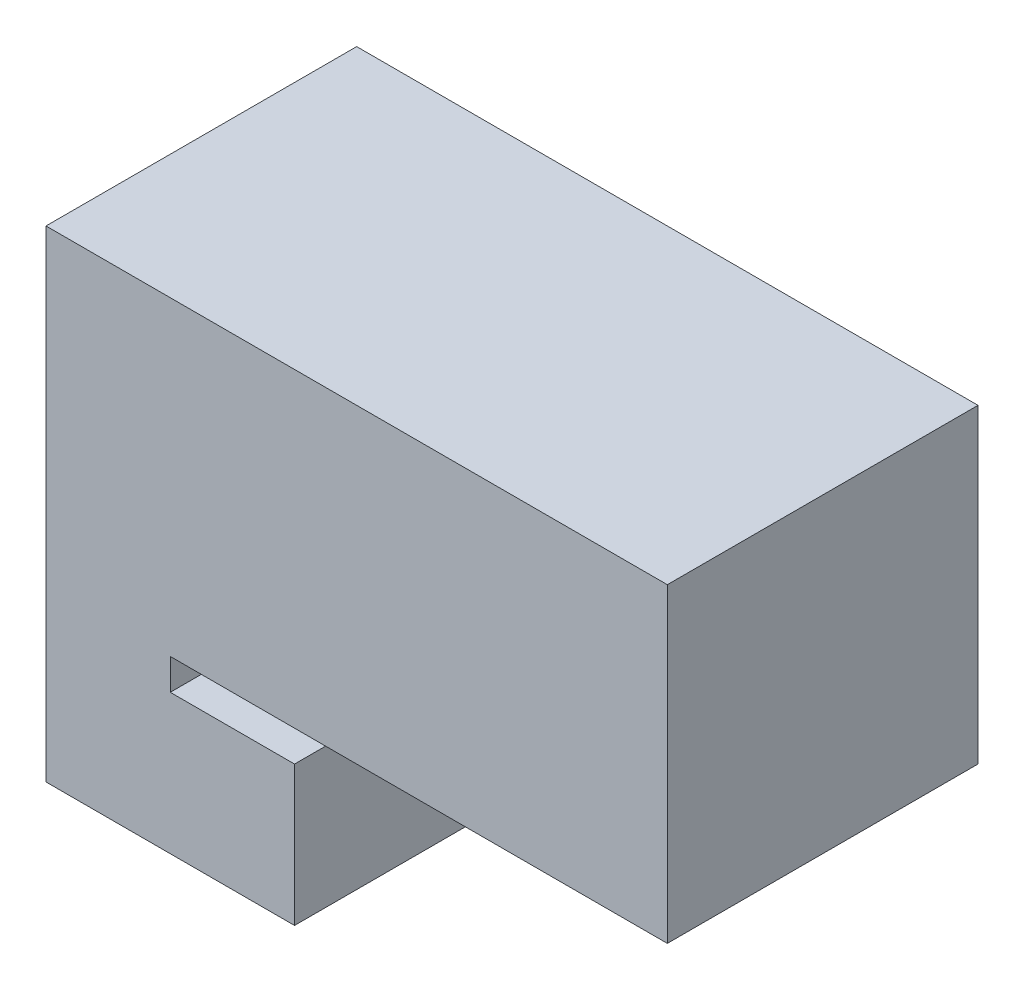
ISO-10303-21;
HEADER;
FILE_DESCRIPTION(('STEP AP214'),'2;1');
FILE_NAME('part.step','',(''),(''),'','','');
FILE_SCHEMA(('AUTOMOTIVE_DESIGN { 1 0 10303 214 1 1 1 1 }'));
ENDSEC;
DATA;
#1=APPLICATION_CONTEXT('core data for automotive mechanical design processes');
#2=APPLICATION_PROTOCOL_DEFINITION('international standard','automotive_design',2000,#1);
#3=PRODUCT_CONTEXT('',#1,'mechanical');
#4=PRODUCT('Part','Part','',(#3));
#5=PRODUCT_RELATED_PRODUCT_CATEGORY('part','',(#4));
#6=PRODUCT_DEFINITION_FORMATION('','',#4);
#7=PRODUCT_DEFINITION_CONTEXT('part definition',#1,'design');
#8=PRODUCT_DEFINITION('design','',#6,#7);
#9=PRODUCT_DEFINITION_SHAPE('','',#8);
#10=(LENGTH_UNIT() NAMED_UNIT(*) SI_UNIT(.MILLI.,.METRE.));
#11=(NAMED_UNIT(*) PLANE_ANGLE_UNIT() SI_UNIT($,.RADIAN.));
#12=(NAMED_UNIT(*) SI_UNIT($,.STERADIAN.) SOLID_ANGLE_UNIT());
#13=UNCERTAINTY_MEASURE_WITH_UNIT(LENGTH_MEASURE(1.E-05),#10,'distance_accuracy_value','');
#14=(GEOMETRIC_REPRESENTATION_CONTEXT(3) GLOBAL_UNCERTAINTY_ASSIGNED_CONTEXT((#13)) GLOBAL_UNIT_ASSIGNED_CONTEXT((#10,
#11,#12)) REPRESENTATION_CONTEXT('',''));
#15=CARTESIAN_POINT('',(0.,0.,0.));
#16=DIRECTION('',(0.,0.,1.));
#17=DIRECTION('',(1.,0.,0.));
#18=AXIS2_PLACEMENT_3D('',#15,#16,#17);
#19=CARTESIAN_POINT('',(-25.4,28.575,63.5));
#20=DIRECTION('',(-1.,0.,0.));
#21=DIRECTION('',(0.,0.,1.));
#22=AXIS2_PLACEMENT_3D('',#19,#20,#21);
#23=PLANE('',#22);
#24=DIRECTION('',(0.,0.,-1.));
#25=VECTOR('',#24,1.);
#26=CARTESIAN_POINT('',(-25.4,34.925,63.5));
#27=LINE('',#26,#25);
#28=CARTESIAN_POINT('',(-25.4,34.925,63.5));
#29=VERTEX_POINT('',#28);
#30=CARTESIAN_POINT('',(-25.4,34.925,0.));
#31=VERTEX_POINT('',#30);
#32=EDGE_CURVE('E48',#29,#31,#27,.T.);
#33=ORIENTED_EDGE('',*,*,#32,.F.);
#34=DIRECTION('',(0.,1.,0.));
#35=VECTOR('',#34,1.);
#36=CARTESIAN_POINT('',(-25.4,28.575,63.5));
#37=LINE('',#36,#35);
#38=CARTESIAN_POINT('',(-25.4,28.575,63.5));
#39=VERTEX_POINT('',#38);
#40=EDGE_CURVE('E120',#39,#29,#37,.T.);
#41=ORIENTED_EDGE('',*,*,#40,.F.);
#42=DIRECTION('',(0.,0.,-1.));
#43=VECTOR('',#42,1.);
#44=CARTESIAN_POINT('',(-25.4,28.575,63.5));
#45=LINE('',#44,#43);
#46=CARTESIAN_POINT('',(-25.4,28.575,0.));
#47=VERTEX_POINT('',#46);
#48=EDGE_CURVE('E139',#39,#47,#45,.T.);
#49=ORIENTED_EDGE('',*,*,#48,.T.);
#50=DIRECTION('',(0.,1.,0.));
#51=VECTOR('',#50,1.);
#52=CARTESIAN_POINT('',(-25.4,28.575,0.));
#53=LINE('',#52,#51);
#54=EDGE_CURVE('E53',#47,#31,#53,.T.);
#55=ORIENTED_EDGE('',*,*,#54,.T.);
#56=EDGE_LOOP('',(#33,#41,#49,#55));
#57=FACE_BOUND('',#56,.T.);
#58=ADVANCED_FACE('F33',(#57),#23,.F.);
#59=CARTESIAN_POINT('',(-25.4,98.425,63.5));
#60=DIRECTION('',(0.,-1.,0.));
#61=DIRECTION('',(1.,0.,0.));
#62=AXIS2_PLACEMENT_3D('',#59,#60,#61);
#63=PLANE('',#62);
#64=DIRECTION('',(-1.,0.,0.));
#65=VECTOR('',#64,1.);
#66=CARTESIAN_POINT('',(-25.4,98.425,0.));
#67=LINE('',#66,#65);
#68=CARTESIAN_POINT('',(76.2,98.425,0.));
#69=VERTEX_POINT('',#68);
#70=CARTESIAN_POINT('',(-50.8,98.425,0.));
#71=VERTEX_POINT('',#70);
#72=EDGE_CURVE('E121',#69,#71,#67,.T.);
#73=ORIENTED_EDGE('',*,*,#72,.T.);
#74=DIRECTION('',(0.,0.,-1.));
#75=VECTOR('',#74,1.);
#76=CARTESIAN_POINT('',(-50.8,98.425,63.5));
#77=LINE('',#76,#75);
#78=CARTESIAN_POINT('',(-50.8,98.425,63.5));
#79=VERTEX_POINT('',#78);
#80=EDGE_CURVE('E11',#79,#71,#77,.T.);
#81=ORIENTED_EDGE('',*,*,#80,.F.);
#82=DIRECTION('',(-1.,0.,0.));
#83=VECTOR('',#82,1.);
#84=CARTESIAN_POINT('',(-25.4,98.425,63.5));
#85=LINE('',#84,#83);
#86=CARTESIAN_POINT('',(76.2,98.425,63.5));
#87=VERTEX_POINT('',#86);
#88=EDGE_CURVE('E129',#87,#79,#85,.T.);
#89=ORIENTED_EDGE('',*,*,#88,.F.);
#90=DIRECTION('',(0.,0.,1.));
#91=VECTOR('',#90,1.);
#92=CARTESIAN_POINT('',(76.2,98.425,63.5));
#93=LINE('',#92,#91);
#94=EDGE_CURVE('E115',#69,#87,#93,.T.);
#95=ORIENTED_EDGE('',*,*,#94,.F.);
#96=EDGE_LOOP('',(#73,#81,#89,#95));
#97=FACE_BOUND('',#96,.T.);
#98=ADVANCED_FACE('F35',(#97),#63,.F.);
#99=CARTESIAN_POINT('',(-50.8,98.425,63.5));
#100=DIRECTION('',(1.,0.,0.));
#101=DIRECTION('',(0.,1.,0.));
#102=AXIS2_PLACEMENT_3D('',#99,#100,#101);
#103=PLANE('',#102);
#104=DIRECTION('',(0.,-1.,0.));
#105=VECTOR('',#104,1.);
#106=CARTESIAN_POINT('',(-50.8,98.425,0.));
#107=LINE('',#106,#105);
#108=CARTESIAN_POINT('',(-50.8,0.,0.));
#109=VERTEX_POINT('',#108);
#110=EDGE_CURVE('E124',#71,#109,#107,.T.);
#111=ORIENTED_EDGE('',*,*,#110,.T.);
#112=DIRECTION('',(0.,0.,-1.));
#113=VECTOR('',#112,1.);
#114=CARTESIAN_POINT('',(-50.8,0.,63.5));
#115=LINE('',#114,#113);
#116=CARTESIAN_POINT('',(-50.8,0.,63.5));
#117=VERTEX_POINT('',#116);
#118=EDGE_CURVE('E41',#117,#109,#115,.T.);
#119=ORIENTED_EDGE('',*,*,#118,.F.);
#120=DIRECTION('',(0.,-1.,0.));
#121=VECTOR('',#120,1.);
#122=CARTESIAN_POINT('',(-50.8,98.425,63.5));
#123=LINE('',#122,#121);
#124=EDGE_CURVE('E131',#79,#117,#123,.T.);
#125=ORIENTED_EDGE('',*,*,#124,.F.);
#126=ORIENTED_EDGE('',*,*,#80,.T.);
#127=EDGE_LOOP('',(#111,#119,#125,#126));
#128=FACE_BOUND('',#127,.T.);
#129=ADVANCED_FACE('F176',(#128),#103,.F.);
#130=CARTESIAN_POINT('',(-50.8,0.,63.5));
#131=DIRECTION('',(0.,1.,0.));
#132=DIRECTION('',(0.,0.,1.));
#133=AXIS2_PLACEMENT_3D('',#130,#131,#132);
#134=PLANE('',#133);
#135=DIRECTION('',(1.,0.,0.));
#136=VECTOR('',#135,1.);
#137=CARTESIAN_POINT('',(-50.8,0.,0.));
#138=LINE('',#137,#136);
#139=CARTESIAN_POINT('',(0.,0.,0.));
#140=VERTEX_POINT('',#139);
#141=EDGE_CURVE('E142',#109,#140,#138,.T.);
#142=ORIENTED_EDGE('',*,*,#141,.T.);
#143=DIRECTION('',(0.,0.,-1.));
#144=VECTOR('',#143,1.);
#145=CARTESIAN_POINT('',(0.,0.,63.5));
#146=LINE('',#145,#144);
#147=CARTESIAN_POINT('',(0.,0.,63.5));
#148=VERTEX_POINT('',#147);
#149=EDGE_CURVE('E153',#148,#140,#146,.T.);
#150=ORIENTED_EDGE('',*,*,#149,.F.);
#151=DIRECTION('',(1.,0.,0.));
#152=VECTOR('',#151,1.);
#153=CARTESIAN_POINT('',(-50.8,0.,63.5));
#154=LINE('',#153,#152);
#155=EDGE_CURVE('E133',#117,#148,#154,.T.);
#156=ORIENTED_EDGE('',*,*,#155,.F.);
#157=ORIENTED_EDGE('',*,*,#118,.T.);
#158=EDGE_LOOP('',(#142,#150,#156,#157));
#159=FACE_BOUND('',#158,.T.);
#160=ADVANCED_FACE('F160',(#159),#134,.F.);
#161=CARTESIAN_POINT('',(0.,0.,63.5));
#162=DIRECTION('',(-1.,0.,0.));
#163=DIRECTION('',(0.,0.,1.));
#164=AXIS2_PLACEMENT_3D('',#161,#162,#163);
#165=PLANE('',#164);
#166=DIRECTION('',(0.,1.,0.));
#167=VECTOR('',#166,1.);
#168=CARTESIAN_POINT('',(0.,0.,0.));
#169=LINE('',#168,#167);
#170=CARTESIAN_POINT('',(0.,28.575,0.));
#171=VERTEX_POINT('',#170);
#172=EDGE_CURVE('E144',#140,#171,#169,.T.);
#173=ORIENTED_EDGE('',*,*,#172,.T.);
#174=DIRECTION('',(0.,0.,-1.));
#175=VECTOR('',#174,1.);
#176=CARTESIAN_POINT('',(0.,28.575,63.5));
#177=LINE('',#176,#175);
#178=CARTESIAN_POINT('',(0.,28.575,63.5));
#179=VERTEX_POINT('',#178);
#180=EDGE_CURVE('E150',#179,#171,#177,.T.);
#181=ORIENTED_EDGE('',*,*,#180,.F.);
#182=DIRECTION('',(0.,1.,0.));
#183=VECTOR('',#182,1.);
#184=CARTESIAN_POINT('',(0.,0.,63.5));
#185=LINE('',#184,#183);
#186=EDGE_CURVE('E135',#148,#179,#185,.T.);
#187=ORIENTED_EDGE('',*,*,#186,.F.);
#188=ORIENTED_EDGE('',*,*,#149,.T.);
#189=EDGE_LOOP('',(#173,#181,#187,#188));
#190=FACE_BOUND('',#189,.T.);
#191=ADVANCED_FACE('F169',(#190),#165,.F.);
#192=CARTESIAN_POINT('',(0.,28.575,63.5));
#193=DIRECTION('',(0.,-1.,0.));
#194=DIRECTION('',(1.,0.,0.));
#195=AXIS2_PLACEMENT_3D('',#192,#193,#194);
#196=PLANE('',#195);
#197=DIRECTION('',(-1.,0.,0.));
#198=VECTOR('',#197,1.);
#199=CARTESIAN_POINT('',(0.,28.575,0.));
#200=LINE('',#199,#198);
#201=EDGE_CURVE('E146',#171,#47,#200,.T.);
#202=ORIENTED_EDGE('',*,*,#201,.T.);
#203=ORIENTED_EDGE('',*,*,#48,.F.);
#204=DIRECTION('',(-1.,0.,0.));
#205=VECTOR('',#204,1.);
#206=CARTESIAN_POINT('',(0.,28.575,63.5));
#207=LINE('',#206,#205);
#208=EDGE_CURVE('E137',#179,#39,#207,.T.);
#209=ORIENTED_EDGE('',*,*,#208,.F.);
#210=ORIENTED_EDGE('',*,*,#180,.T.);
#211=EDGE_LOOP('',(#202,#203,#209,#210));
#212=FACE_BOUND('',#211,.T.);
#213=ADVANCED_FACE('F173',(#212),#196,.F.);
#214=CARTESIAN_POINT('',(0.,0.,63.5));
#215=DIRECTION('',(0.,0.,1.));
#216=DIRECTION('',(1.,0.,0.));
#217=AXIS2_PLACEMENT_3D('',#214,#215,#216);
#218=PLANE('',#217);
#219=ORIENTED_EDGE('',*,*,#88,.T.);
#220=ORIENTED_EDGE('',*,*,#124,.T.);
#221=ORIENTED_EDGE('',*,*,#155,.T.);
#222=ORIENTED_EDGE('',*,*,#186,.T.);
#223=ORIENTED_EDGE('',*,*,#208,.T.);
#224=ORIENTED_EDGE('',*,*,#40,.T.);
#225=DIRECTION('',(-1.,0.,0.));
#226=VECTOR('',#225,1.);
#227=CARTESIAN_POINT('',(76.2,34.925,63.5));
#228=LINE('',#227,#226);
#229=CARTESIAN_POINT('',(76.2,34.925,63.5));
#230=VERTEX_POINT('',#229);
#231=EDGE_CURVE('E102',#230,#29,#228,.T.);
#232=ORIENTED_EDGE('',*,*,#231,.F.);
#233=DIRECTION('',(0.,-1.,0.));
#234=VECTOR('',#233,1.);
#235=CARTESIAN_POINT('',(76.2,34.925,63.5));
#236=LINE('',#235,#234);
#237=EDGE_CURVE('E109',#87,#230,#236,.T.);
#238=ORIENTED_EDGE('',*,*,#237,.F.);
#239=EDGE_LOOP('',(#219,#220,#221,#222,#223,#224,#232,#238));
#240=FACE_BOUND('',#239,.T.);
#241=ADVANCED_FACE('F119',(#240),#218,.T.);
#242=CARTESIAN_POINT('',(0.,0.,0.));
#243=DIRECTION('',(0.,0.,1.));
#244=DIRECTION('',(1.,0.,0.));
#245=AXIS2_PLACEMENT_3D('',#242,#243,#244);
#246=PLANE('',#245);
#247=ORIENTED_EDGE('',*,*,#72,.F.);
#248=DIRECTION('',(0.,1.,0.));
#249=VECTOR('',#248,1.);
#250=CARTESIAN_POINT('',(76.2,34.925,0.));
#251=LINE('',#250,#249);
#252=CARTESIAN_POINT('',(76.2,34.925,0.));
#253=VERTEX_POINT('',#252);
#254=EDGE_CURVE('E108',#253,#69,#251,.T.);
#255=ORIENTED_EDGE('',*,*,#254,.F.);
#256=DIRECTION('',(-1.,0.,0.));
#257=VECTOR('',#256,1.);
#258=CARTESIAN_POINT('',(76.2,34.925,0.));
#259=LINE('',#258,#257);
#260=EDGE_CURVE('E104',#253,#31,#259,.T.);
#261=ORIENTED_EDGE('',*,*,#260,.T.);
#262=ORIENTED_EDGE('',*,*,#54,.F.);
#263=ORIENTED_EDGE('',*,*,#201,.F.);
#264=ORIENTED_EDGE('',*,*,#172,.F.);
#265=ORIENTED_EDGE('',*,*,#141,.F.);
#266=ORIENTED_EDGE('',*,*,#110,.F.);
#267=EDGE_LOOP('',(#247,#255,#261,#262,#263,#264,#265,#266));
#268=FACE_BOUND('',#267,.T.);
#269=ADVANCED_FACE('F165',(#268),#246,.F.);
#270=CARTESIAN_POINT('',(76.2,34.925,63.5));
#271=DIRECTION('',(0.,1.,0.));
#272=DIRECTION('',(0.,0.,1.));
#273=AXIS2_PLACEMENT_3D('',#270,#271,#272);
#274=PLANE('',#273);
#275=ORIENTED_EDGE('',*,*,#32,.T.);
#276=ORIENTED_EDGE('',*,*,#260,.F.);
#277=DIRECTION('',(0.,0.,-1.));
#278=VECTOR('',#277,1.);
#279=CARTESIAN_POINT('',(76.2,34.925,63.5));
#280=LINE('',#279,#278);
#281=EDGE_CURVE('E98',#230,#253,#280,.T.);
#282=ORIENTED_EDGE('',*,*,#281,.F.);
#283=ORIENTED_EDGE('',*,*,#231,.T.);
#284=EDGE_LOOP('',(#275,#276,#282,#283));
#285=FACE_BOUND('',#284,.T.);
#286=ADVANCED_FACE('F100',(#285),#274,.F.);
#287=CARTESIAN_POINT('',(76.2,0.,0.));
#288=DIRECTION('',(-1.,0.,0.));
#289=DIRECTION('',(0.,0.,1.));
#290=AXIS2_PLACEMENT_3D('',#287,#288,#289);
#291=PLANE('',#290);
#292=ORIENTED_EDGE('',*,*,#237,.T.);
#293=ORIENTED_EDGE('',*,*,#281,.T.);
#294=ORIENTED_EDGE('',*,*,#254,.T.);
#295=ORIENTED_EDGE('',*,*,#94,.T.);
#296=EDGE_LOOP('',(#292,#293,#294,#295));
#297=FACE_BOUND('',#296,.T.);
#298=ADVANCED_FACE('F113',(#297),#291,.F.);
#299=CLOSED_SHELL('',(#58,#98,#129,#160,#191,#213,#241,#269,#286,#298));
#300=MANIFOLD_SOLID_BREP('B2',#299);
#301=ADVANCED_BREP_SHAPE_REPRESENTATION('',(#18,#300),#14);
#302=SHAPE_DEFINITION_REPRESENTATION(#9,#301);
ENDSEC;
END-ISO-10303-21;
